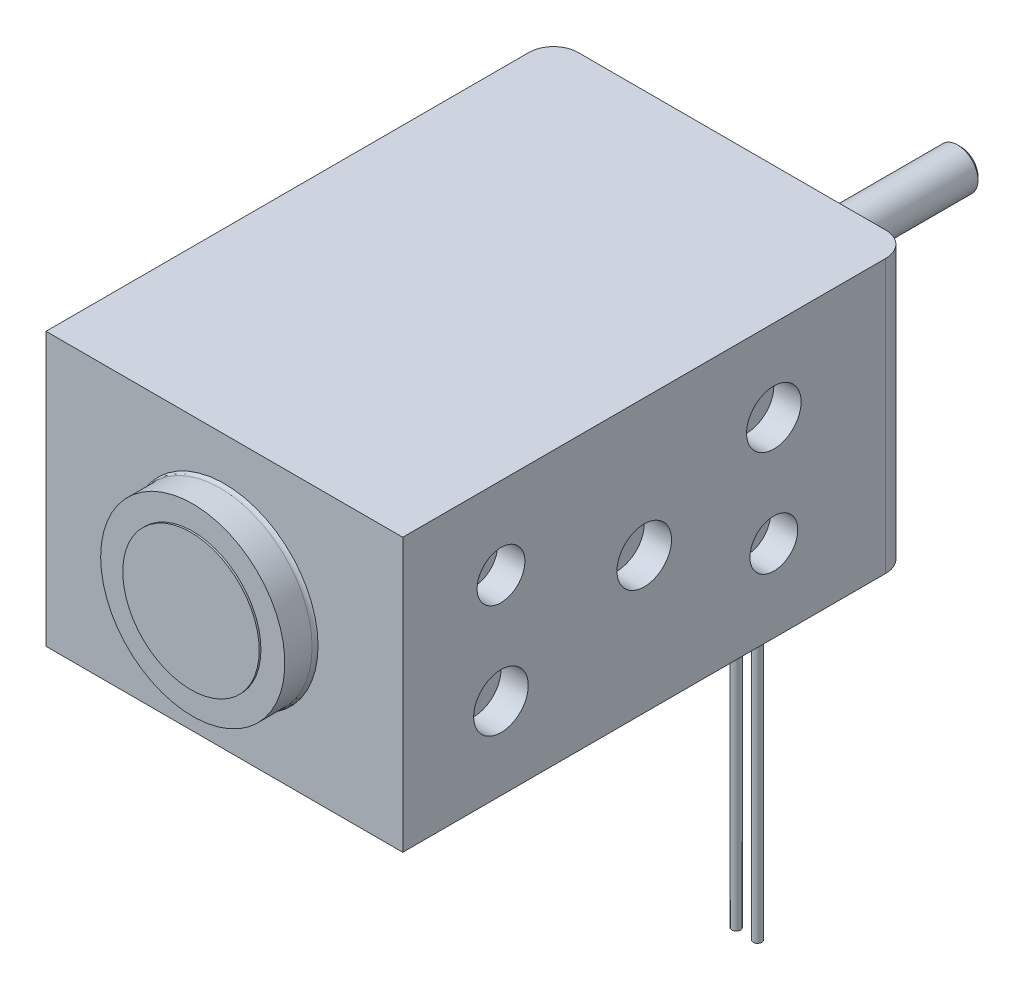
ISO-10303-21;
HEADER;
FILE_DESCRIPTION(('STEP AP214'),'2;1');
FILE_NAME('part.step','',(''),(''),'','','');
FILE_SCHEMA(('AUTOMOTIVE_DESIGN { 1 0 10303 214 1 1 1 1 }'));
ENDSEC;
DATA;
#1=APPLICATION_CONTEXT('core data for automotive mechanical design processes');
#2=APPLICATION_PROTOCOL_DEFINITION('international standard','automotive_design',2000,#1);
#3=PRODUCT_CONTEXT('',#1,'mechanical');
#4=PRODUCT('Part','Part','',(#3));
#5=PRODUCT_RELATED_PRODUCT_CATEGORY('part','',(#4));
#6=PRODUCT_DEFINITION_FORMATION('','',#4);
#7=PRODUCT_DEFINITION_CONTEXT('part definition',#1,'design');
#8=PRODUCT_DEFINITION('design','',#6,#7);
#9=PRODUCT_DEFINITION_SHAPE('','',#8);
#10=(LENGTH_UNIT() NAMED_UNIT(*) SI_UNIT(.MILLI.,.METRE.));
#11=(NAMED_UNIT(*) PLANE_ANGLE_UNIT() SI_UNIT($,.RADIAN.));
#12=(NAMED_UNIT(*) SI_UNIT($,.STERADIAN.) SOLID_ANGLE_UNIT());
#13=UNCERTAINTY_MEASURE_WITH_UNIT(LENGTH_MEASURE(1.E-05),#10,'distance_accuracy_value','');
#14=(GEOMETRIC_REPRESENTATION_CONTEXT(3) GLOBAL_UNCERTAINTY_ASSIGNED_CONTEXT((#13)) GLOBAL_UNIT_ASSIGNED_CONTEXT((#10,
#11,#12)) REPRESENTATION_CONTEXT('',''));
#15=CARTESIAN_POINT('',(0.,0.,0.));
#16=DIRECTION('',(0.,0.,1.));
#17=DIRECTION('',(1.,0.,0.));
#18=AXIS2_PLACEMENT_3D('',#15,#16,#17);
#19=CARTESIAN_POINT('',(-13.0750000000002,8.61064959709757,45.9100000000001));
#20=DIRECTION('',(0.,0.,1.00000000000001));
#21=DIRECTION('',(1.,0.,0.));
#22=AXIS2_PLACEMENT_3D('',#19,#20,#21);
#23=CYLINDRICAL_SURFACE('',#22,5.);
#24=CARTESIAN_POINT('',(-13.0750000000002,8.61064959709754,39.5200000000004));
#25=DIRECTION('',(0.,0.,1.00000000000001));
#26=DIRECTION('',(1.,0.,0.));
#27=AXIS2_PLACEMENT_3D('',#24,#25,#26);
#28=CIRCLE('',#27,5.);
#29=CARTESIAN_POINT('',(-8.07500000000017,8.61064959709754,39.5200000000004));
#30=VERTEX_POINT('',#29);
#31=EDGE_CURVE('E50',#30,#30,#28,.F.);
#32=ORIENTED_EDGE('',*,*,#31,.F.);
#33=EDGE_LOOP('',(#32));
#34=FACE_BOUND('',#33,.T.);
#35=CARTESIAN_POINT('',(-13.0750000000002,8.61064959709754,39.6470000000004));
#36=DIRECTION('',(0.,0.,1.00000000000001));
#37=DIRECTION('',(1.,0.,0.));
#38=AXIS2_PLACEMENT_3D('',#35,#36,#37);
#39=CIRCLE('',#38,5.);
#40=CARTESIAN_POINT('',(-8.07500000000017,8.61064959709754,39.6470000000004));
#41=VERTEX_POINT('',#40);
#42=EDGE_CURVE('E391',#41,#41,#39,.F.);
#43=ORIENTED_EDGE('',*,*,#42,.T.);
#44=EDGE_LOOP('',(#43));
#45=FACE_BOUND('',#44,.T.);
#46=ADVANCED_FACE('F47',(#34,#45),#23,.T.);
#47=CARTESIAN_POINT('',(-13.0750000000002,8.61064959709753,39.5200000000004));
#48=DIRECTION('',(0.,0.,1.00000000000001));
#49=DIRECTION('',(1.,0.,0.));
#50=AXIS2_PLACEMENT_3D('',#47,#48,#49);
#51=PLANE('',#50);
#52=CARTESIAN_POINT('',(-13.0750000000002,8.61064959709753,39.5200000000004));
#53=DIRECTION('',(0.,0.,-1.00000000000001));
#54=DIRECTION('',(-1.,0.,0.));
#55=AXIS2_PLACEMENT_3D('',#52,#53,#54);
#56=CIRCLE('',#55,6.75);
#57=CARTESIAN_POINT('',(-19.8250000000002,8.61064959709753,39.5200000000004));
#58=VERTEX_POINT('',#57);
#59=EDGE_CURVE('E387',#58,#58,#56,.T.);
#60=ORIENTED_EDGE('',*,*,#59,.F.);
#61=EDGE_LOOP('',(#60));
#62=FACE_BOUND('',#61,.T.);
#63=ORIENTED_EDGE('',*,*,#31,.T.);
#64=EDGE_LOOP('',(#63));
#65=FACE_BOUND('',#64,.T.);
#66=ADVANCED_FACE('F248',(#62,#65),#51,.T.);
#67=CARTESIAN_POINT('',(-13.0750000000002,8.6106495970974,-16.7900000000003));
#68=DIRECTION('',(0.,0.,-1.00000000000001));
#69=DIRECTION('',(-1.,0.,0.));
#70=AXIS2_PLACEMENT_3D('',#67,#68,#69);
#71=PLANE('',#70);
#72=CARTESIAN_POINT('',(-13.0750000000002,8.6106495970974,-16.7900000000714));
#73=DIRECTION('',(0.,0.,1.00000000000001));
#74=DIRECTION('',(1.,0.,0.));
#75=AXIS2_PLACEMENT_3D('',#72,#73,#74);
#76=CIRCLE('',#75,1.25000000005166);
#77=CARTESIAN_POINT('',(-11.8249999999485,8.6106495970974,-16.7900000000714));
#78=VERTEX_POINT('',#77);
#79=EDGE_CURVE('E385',#78,#78,#76,.T.);
#80=ORIENTED_EDGE('',*,*,#79,.F.);
#81=EDGE_LOOP('',(#80));
#82=FACE_BOUND('',#81,.T.);
#83=ADVANCED_FACE('F245',(#82),#71,.T.);
#84=CARTESIAN_POINT('',(-6.84869644595532,-25.2393504029029,5.90843329506097));
#85=DIRECTION('',(0.,-1.00000000000001,0.));
#86=DIRECTION('',(0.,0.,-1.00000000000001));
#87=AXIS2_PLACEMENT_3D('',#84,#85,#86);
#88=PLANE('',#87);
#89=CARTESIAN_POINT('',(-6.84869644595532,-25.2393504029029,5.90843329506097));
#90=DIRECTION('',(0.,-1.00000000000001,0.));
#91=DIRECTION('',(0.,0.,-1.00000000000001));
#92=AXIS2_PLACEMENT_3D('',#89,#90,#91);
#93=CIRCLE('',#92,0.3175);
#94=CARTESIAN_POINT('',(-6.84869644595532,-25.2393504029029,5.59093329506096));
#95=VERTEX_POINT('',#94);
#96=EDGE_CURVE('E382',#95,#95,#93,.F.);
#97=ORIENTED_EDGE('',*,*,#96,.F.);
#98=EDGE_LOOP('',(#97));
#99=FACE_BOUND('',#98,.T.);
#100=ADVANCED_FACE('F241',(#99),#88,.T.);
#101=CARTESIAN_POINT('',(-5.29377165765865,-25.2393504029029,5.90843329506097));
#102=DIRECTION('',(0.,-1.00000000000001,0.));
#103=DIRECTION('',(0.,0.,-1.00000000000001));
#104=AXIS2_PLACEMENT_3D('',#101,#102,#103);
#105=PLANE('',#104);
#106=CARTESIAN_POINT('',(-5.29377165765865,-25.2393504029029,5.90843329506097));
#107=DIRECTION('',(0.,-1.00000000000001,0.));
#108=DIRECTION('',(0.,0.,-1.00000000000001));
#109=AXIS2_PLACEMENT_3D('',#106,#107,#108);
#110=CIRCLE('',#109,0.3175);
#111=CARTESIAN_POINT('',(-5.29377165765865,-25.2393504029029,5.59093329506096));
#112=VERTEX_POINT('',#111);
#113=EDGE_CURVE('E379',#112,#112,#110,.F.);
#114=ORIENTED_EDGE('',*,*,#113,.F.);
#115=EDGE_LOOP('',(#114));
#116=FACE_BOUND('',#115,.T.);
#117=ADVANCED_FACE('F237',(#116),#105,.T.);
#118=CARTESIAN_POINT('',(-1.99999999999978,8.6106495970975,19.4999999999999));
#119=DIRECTION('',(1.,0.,0.));
#120=DIRECTION('',(0.,0.,-1.00000000000001));
#121=AXIS2_PLACEMENT_3D('',#118,#119,#120);
#122=PLANE('',#121);
#123=CARTESIAN_POINT('',(-1.99999999999978,8.6106495970975,19.4999999999999));
#124=DIRECTION('',(1.,0.,0.));
#125=DIRECTION('',(0.,0.,-1.00000000000001));
#126=AXIS2_PLACEMENT_3D('',#123,#124,#125);
#127=CIRCLE('',#126,2.);
#128=CARTESIAN_POINT('',(-1.99999999999978,8.61064959709749,17.4999999999998));
#129=VERTEX_POINT('',#128);
#130=EDGE_CURVE('E376',#129,#129,#127,.T.);
#131=ORIENTED_EDGE('',*,*,#130,.T.);
#132=EDGE_LOOP('',(#131));
#133=FACE_BOUND('',#132,.T.);
#134=ADVANCED_FACE('F233',(#133),#122,.T.);
#135=CARTESIAN_POINT('',(-1.99999999999978,12.6106495970975,9.99999999999979));
#136=DIRECTION('',(1.,0.,0.));
#137=DIRECTION('',(0.,0.,-1.00000000000001));
#138=AXIS2_PLACEMENT_3D('',#135,#136,#137);
#139=PLANE('',#138);
#140=CARTESIAN_POINT('',(-1.99999999999978,12.6106495970975,9.99999999999979));
#141=DIRECTION('',(1.,0.,0.));
#142=DIRECTION('',(0.,0.,-1.00000000000001));
#143=AXIS2_PLACEMENT_3D('',#140,#141,#142);
#144=CIRCLE('',#143,2.);
#145=CARTESIAN_POINT('',(-1.99999999999978,12.6106495970975,7.99999999999977));
#146=VERTEX_POINT('',#145);
#147=EDGE_CURVE('E373',#146,#146,#144,.T.);
#148=ORIENTED_EDGE('',*,*,#147,.T.);
#149=EDGE_LOOP('',(#148));
#150=FACE_BOUND('',#149,.T.);
#151=ADVANCED_FACE('F229',(#150),#139,.T.);
#152=CARTESIAN_POINT('',(-1.99999999999978,4.61064959709748,30.0000000000002));
#153=DIRECTION('',(1.,0.,0.));
#154=DIRECTION('',(0.,0.,-1.00000000000001));
#155=AXIS2_PLACEMENT_3D('',#152,#153,#154);
#156=PLANE('',#155);
#157=CARTESIAN_POINT('',(-1.99999999999978,4.61064959709748,30.0000000000002));
#158=DIRECTION('',(1.,0.,0.));
#159=DIRECTION('',(0.,0.,-1.00000000000001));
#160=AXIS2_PLACEMENT_3D('',#157,#158,#159);
#161=CIRCLE('',#160,2.);
#162=CARTESIAN_POINT('',(-1.99999999999978,4.61064959709748,28.0000000000002));
#163=VERTEX_POINT('',#162);
#164=EDGE_CURVE('E370',#163,#163,#161,.T.);
#165=ORIENTED_EDGE('',*,*,#164,.T.);
#166=EDGE_LOOP('',(#165));
#167=FACE_BOUND('',#166,.T.);
#168=ADVANCED_FACE('F225',(#167),#156,.T.);
#169=CARTESIAN_POINT('',(-1.99999999999978,4.61064959709745,9.99999999999979));
#170=DIRECTION('',(1.,0.,0.));
#171=DIRECTION('',(0.,0.,-1.00000000000001));
#172=AXIS2_PLACEMENT_3D('',#169,#170,#171);
#173=PLANE('',#172);
#174=CARTESIAN_POINT('',(-1.99999999999978,4.61064959709745,9.99999999999979));
#175=DIRECTION('',(1.,0.,0.));
#176=DIRECTION('',(0.,0.,-1.00000000000001));
#177=AXIS2_PLACEMENT_3D('',#174,#175,#176);
#178=CIRCLE('',#177,1.7526);
#179=CARTESIAN_POINT('',(-1.99999999999978,4.61064959709744,8.24739999999977));
#180=VERTEX_POINT('',#179);
#181=EDGE_CURVE('E367',#180,#180,#178,.T.);
#182=ORIENTED_EDGE('',*,*,#181,.T.);
#183=EDGE_LOOP('',(#182));
#184=FACE_BOUND('',#183,.T.);
#185=ADVANCED_FACE('F221',(#184),#173,.T.);
#186=CARTESIAN_POINT('',(-1.99999999999978,12.6106495970976,30.0000000000002));
#187=DIRECTION('',(1.,0.,0.));
#188=DIRECTION('',(0.,0.,-1.00000000000001));
#189=AXIS2_PLACEMENT_3D('',#186,#187,#188);
#190=PLANE('',#189);
#191=CARTESIAN_POINT('',(-1.99999999999978,12.6106495970976,30.0000000000002));
#192=DIRECTION('',(1.,0.,0.));
#193=DIRECTION('',(0.,0.,-1.00000000000001));
#194=AXIS2_PLACEMENT_3D('',#191,#192,#193);
#195=CIRCLE('',#194,1.7526);
#196=CARTESIAN_POINT('',(-1.99999999999978,12.6106495970976,28.2474000000002));
#197=VERTEX_POINT('',#196);
#198=EDGE_CURVE('E364',#197,#197,#195,.T.);
#199=ORIENTED_EDGE('',*,*,#198,.T.);
#200=EDGE_LOOP('',(#199));
#201=FACE_BOUND('',#200,.T.);
#202=ADVANCED_FACE('F217',(#201),#190,.T.);
#203=CARTESIAN_POINT('',(-13.0750000000002,8.61064959709753,39.5200000000004));
#204=DIRECTION('',(0.,0.,-1.00000000000001));
#205=DIRECTION('',(-1.,0.,0.));
#206=AXIS2_PLACEMENT_3D('',#203,#204,#205);
#207=CYLINDRICAL_SURFACE('',#206,6.75);
#208=CARTESIAN_POINT('',(-13.0750000000002,8.61064959709753,37.5199999999998));
#209=DIRECTION('',(0.,0.,1.00000000000001));
#210=DIRECTION('',(1.,0.,0.));
#211=AXIS2_PLACEMENT_3D('',#208,#209,#210);
#212=CIRCLE('',#211,6.75);
#213=CARTESIAN_POINT('',(-6.32500000000017,8.61064959709753,37.5199999999998));
#214=VERTEX_POINT('',#213);
#215=EDGE_CURVE('E363',#214,#214,#212,.T.);
#216=ORIENTED_EDGE('',*,*,#215,.T.);
#217=EDGE_LOOP('',(#216));
#218=FACE_BOUND('',#217,.T.);
#219=ORIENTED_EDGE('',*,*,#59,.T.);
#220=EDGE_LOOP('',(#219));
#221=FACE_BOUND('',#220,.T.);
#222=ADVANCED_FACE('F213',(#218,#221),#207,.T.);
#223=CARTESIAN_POINT('',(-24.3500000000001,8.6106495970975,19.4999999999999));
#224=DIRECTION('',(1.,0.,0.));
#225=DIRECTION('',(0.,0.,-1.00000000000001));
#226=AXIS2_PLACEMENT_3D('',#223,#224,#225);
#227=PLANE('',#226);
#228=CARTESIAN_POINT('',(-24.3500000000001,8.6106495970975,19.4999999999999));
#229=DIRECTION('',(-1.,0.,0.));
#230=DIRECTION('',(0.,0.,1.00000000000001));
#231=AXIS2_PLACEMENT_3D('',#228,#229,#230);
#232=CIRCLE('',#231,2.);
#233=CARTESIAN_POINT('',(-24.3500000000001,8.6106495970975,21.4999999999999));
#234=VERTEX_POINT('',#233);
#235=EDGE_CURVE('E360',#234,#234,#232,.T.);
#236=ORIENTED_EDGE('',*,*,#235,.T.);
#237=EDGE_LOOP('',(#236));
#238=FACE_BOUND('',#237,.T.);
#239=ADVANCED_FACE('F209',(#238),#227,.F.);
#240=CARTESIAN_POINT('',(-24.3500000000001,4.61064959709744,9.99999999999979));
#241=DIRECTION('',(1.,0.,0.));
#242=DIRECTION('',(0.,0.,-1.00000000000001));
#243=AXIS2_PLACEMENT_3D('',#240,#241,#242);
#244=PLANE('',#243);
#245=CARTESIAN_POINT('',(-24.3500000000001,4.61064959709744,9.99999999999979));
#246=DIRECTION('',(-1.,0.,0.));
#247=DIRECTION('',(0.,0.,1.00000000000001));
#248=AXIS2_PLACEMENT_3D('',#245,#246,#247);
#249=CIRCLE('',#248,2.00000000000001);
#250=CARTESIAN_POINT('',(-24.3500000000001,4.61064959709745,11.9999999999998));
#251=VERTEX_POINT('',#250);
#252=EDGE_CURVE('E314',#251,#251,#249,.T.);
#253=ORIENTED_EDGE('',*,*,#252,.T.);
#254=EDGE_LOOP('',(#253));
#255=FACE_BOUND('',#254,.T.);
#256=ADVANCED_FACE('F205',(#255),#244,.F.);
#257=CARTESIAN_POINT('',(-24.3500000000001,12.6106495970975,9.99999999999979));
#258=DIRECTION('',(1.,0.,0.));
#259=DIRECTION('',(0.,0.,-1.00000000000001));
#260=AXIS2_PLACEMENT_3D('',#257,#258,#259);
#261=PLANE('',#260);
#262=CARTESIAN_POINT('',(-24.3500000000001,12.6106495970975,9.99999999999979));
#263=DIRECTION('',(-1.,0.,0.));
#264=DIRECTION('',(0.,0.,1.00000000000001));
#265=AXIS2_PLACEMENT_3D('',#262,#263,#264);
#266=CIRCLE('',#265,1.7526);
#267=CARTESIAN_POINT('',(-24.3500000000001,12.6106495970975,11.7525999999998));
#268=VERTEX_POINT('',#267);
#269=EDGE_CURVE('E356',#268,#268,#266,.T.);
#270=ORIENTED_EDGE('',*,*,#269,.T.);
#271=EDGE_LOOP('',(#270));
#272=FACE_BOUND('',#271,.T.);
#273=ADVANCED_FACE('F201',(#272),#261,.F.);
#274=CARTESIAN_POINT('',(-24.3500000000001,4.61064959709748,30.0000000000002));
#275=DIRECTION('',(1.,0.,0.));
#276=DIRECTION('',(0.,0.,-1.00000000000001));
#277=AXIS2_PLACEMENT_3D('',#274,#275,#276);
#278=PLANE('',#277);
#279=CARTESIAN_POINT('',(-24.3500000000001,4.61064959709748,30.0000000000002));
#280=DIRECTION('',(-1.,0.,0.));
#281=DIRECTION('',(0.,0.,1.00000000000001));
#282=AXIS2_PLACEMENT_3D('',#279,#280,#281);
#283=CIRCLE('',#282,1.7526);
#284=CARTESIAN_POINT('',(-24.3500000000001,4.61064959709748,31.7526000000003));
#285=VERTEX_POINT('',#284);
#286=EDGE_CURVE('E353',#285,#285,#283,.T.);
#287=ORIENTED_EDGE('',*,*,#286,.T.);
#288=EDGE_LOOP('',(#287));
#289=FACE_BOUND('',#288,.T.);
#290=ADVANCED_FACE('F197',(#289),#278,.F.);
#291=CARTESIAN_POINT('',(-24.3500000000001,12.6106495970976,30.0000000000002));
#292=DIRECTION('',(1.,0.,0.));
#293=DIRECTION('',(0.,0.,-1.00000000000001));
#294=AXIS2_PLACEMENT_3D('',#291,#292,#293);
#295=PLANE('',#294);
#296=CARTESIAN_POINT('',(-24.3500000000001,12.6106495970976,30.0000000000002));
#297=DIRECTION('',(-1.,0.,0.));
#298=DIRECTION('',(0.,0.,1.00000000000001));
#299=AXIS2_PLACEMENT_3D('',#296,#297,#298);
#300=CIRCLE('',#299,2.);
#301=CARTESIAN_POINT('',(-24.3500000000001,12.6106495970976,32.0000000000003));
#302=VERTEX_POINT('',#301);
#303=EDGE_CURVE('E350',#302,#302,#300,.T.);
#304=ORIENTED_EDGE('',*,*,#303,.T.);
#305=EDGE_LOOP('',(#304));
#306=FACE_BOUND('',#305,.T.);
#307=ADVANCED_FACE('F193',(#306),#295,.F.);
#308=CARTESIAN_POINT('',(-13.0750000000002,8.6106495970974,-16.5400000000773));
#309=DIRECTION('',(0.,0.,1.00000000000001));
#310=DIRECTION('',(1.,0.,0.));
#311=AXIS2_PLACEMENT_3D('',#308,#309,#310);
#312=CONICAL_SURFACE('',#311,1.50000000004739,0.785398163400727);
#313=ORIENTED_EDGE('',*,*,#79,.T.);
#314=EDGE_LOOP('',(#313));
#315=FACE_BOUND('',#314,.T.);
#316=CARTESIAN_POINT('',(-13.0750000000002,8.6106495970974,-16.54));
#317=DIRECTION('',(0.,0.,1.00000000000001));
#318=DIRECTION('',(1.,0.,0.));
#319=AXIS2_PLACEMENT_3D('',#316,#317,#318);
#320=CIRCLE('',#319,1.5);
#321=CARTESIAN_POINT('',(-11.5750000000002,8.6106495970974,-16.54));
#322=VERTEX_POINT('',#321);
#323=EDGE_CURVE('E152',#322,#322,#320,.T.);
#324=ORIENTED_EDGE('',*,*,#323,.F.);
#325=EDGE_LOOP('',(#324));
#326=FACE_BOUND('',#325,.T.);
#327=ADVANCED_FACE('F189',(#315,#326),#312,.T.);
#328=CARTESIAN_POINT('',(-6.84869644595532,9.50867520920438,5.90843329506097));
#329=DIRECTION('',(0.,-1.00000000000001,0.));
#330=DIRECTION('',(0.,0.,-1.00000000000001));
#331=AXIS2_PLACEMENT_3D('',#328,#329,#330);
#332=CYLINDRICAL_SURFACE('',#331,0.3175);
#333=CARTESIAN_POINT('',(-6.84869644595532,-1.3893504029026,5.90843329506097));
#334=DIRECTION('',(0.,-1.00000000000001,0.));
#335=DIRECTION('',(0.,0.,-1.00000000000001));
#336=AXIS2_PLACEMENT_3D('',#333,#334,#335);
#337=CIRCLE('',#336,0.3175);
#338=CARTESIAN_POINT('',(-6.84869644595532,-1.38935040290261,5.59093329506096));
#339=VERTEX_POINT('',#338);
#340=EDGE_CURVE('E347',#339,#339,#337,.F.);
#341=ORIENTED_EDGE('',*,*,#340,.F.);
#342=EDGE_LOOP('',(#341));
#343=FACE_BOUND('',#342,.T.);
#344=ORIENTED_EDGE('',*,*,#96,.T.);
#345=EDGE_LOOP('',(#344));
#346=FACE_BOUND('',#345,.T.);
#347=ADVANCED_FACE('F185',(#343,#346),#332,.T.);
#348=CARTESIAN_POINT('',(-5.29377165765865,9.50867520920438,5.90843329506097));
#349=DIRECTION('',(0.,-1.00000000000001,0.));
#350=DIRECTION('',(0.,0.,-1.00000000000001));
#351=AXIS2_PLACEMENT_3D('',#348,#349,#350);
#352=CYLINDRICAL_SURFACE('',#351,0.3175);
#353=CARTESIAN_POINT('',(-5.29377165765865,-1.3893504029026,5.90843329506097));
#354=DIRECTION('',(0.,-1.00000000000001,0.));
#355=DIRECTION('',(0.,0.,-1.00000000000001));
#356=AXIS2_PLACEMENT_3D('',#353,#354,#355);
#357=CIRCLE('',#356,0.3175);
#358=CARTESIAN_POINT('',(-5.29377165765865,-1.38935040290261,5.59093329506096));
#359=VERTEX_POINT('',#358);
#360=EDGE_CURVE('E344',#359,#359,#357,.F.);
#361=ORIENTED_EDGE('',*,*,#360,.F.);
#362=EDGE_LOOP('',(#361));
#363=FACE_BOUND('',#362,.T.);
#364=ORIENTED_EDGE('',*,*,#113,.T.);
#365=EDGE_LOOP('',(#364));
#366=FACE_BOUND('',#365,.T.);
#367=ADVANCED_FACE('F181',(#363,#366),#352,.T.);
#368=CARTESIAN_POINT('',(-20.,8.6106495970975,19.4999999999999));
#369=DIRECTION('',(1.,0.,0.));
#370=DIRECTION('',(0.,0.,-1.00000000000001));
#371=AXIS2_PLACEMENT_3D('',#368,#369,#370);
#372=CYLINDRICAL_SURFACE('',#371,2.);
#373=ORIENTED_EDGE('',*,*,#130,.F.);
#374=EDGE_LOOP('',(#373));
#375=FACE_BOUND('',#374,.T.);
#376=CARTESIAN_POINT('',(0.,8.6106495970975,19.4999999999999));
#377=DIRECTION('',(1.,0.,0.));
#378=DIRECTION('',(0.,0.,-1.00000000000001));
#379=AXIS2_PLACEMENT_3D('',#376,#377,#378);
#380=CIRCLE('',#379,2.);
#381=CARTESIAN_POINT('',(0.,8.61064959709749,17.4999999999998));
#382=VERTEX_POINT('',#381);
#383=EDGE_CURVE('E341',#382,#382,#380,.T.);
#384=ORIENTED_EDGE('',*,*,#383,.T.);
#385=EDGE_LOOP('',(#384));
#386=FACE_BOUND('',#385,.T.);
#387=ADVANCED_FACE('F177',(#375,#386),#372,.F.);
#388=CARTESIAN_POINT('',(-20.,12.6106495970975,9.99999999999979));
#389=DIRECTION('',(1.,0.,0.));
#390=DIRECTION('',(0.,0.,-1.00000000000001));
#391=AXIS2_PLACEMENT_3D('',#388,#389,#390);
#392=CYLINDRICAL_SURFACE('',#391,2.);
#393=ORIENTED_EDGE('',*,*,#147,.F.);
#394=EDGE_LOOP('',(#393));
#395=FACE_BOUND('',#394,.T.);
#396=CARTESIAN_POINT('',(0.,12.6106495970975,9.99999999999979));
#397=DIRECTION('',(1.,0.,0.));
#398=DIRECTION('',(0.,0.,-1.00000000000001));
#399=AXIS2_PLACEMENT_3D('',#396,#397,#398);
#400=CIRCLE('',#399,2.);
#401=CARTESIAN_POINT('',(0.,12.6106495970975,7.99999999999977));
#402=VERTEX_POINT('',#401);
#403=EDGE_CURVE('E338',#402,#402,#400,.T.);
#404=ORIENTED_EDGE('',*,*,#403,.T.);
#405=EDGE_LOOP('',(#404));
#406=FACE_BOUND('',#405,.T.);
#407=ADVANCED_FACE('F173',(#395,#406),#392,.F.);
#408=CARTESIAN_POINT('',(-20.,4.61064959709748,30.0000000000002));
#409=DIRECTION('',(1.,0.,0.));
#410=DIRECTION('',(0.,0.,-1.00000000000001));
#411=AXIS2_PLACEMENT_3D('',#408,#409,#410);
#412=CYLINDRICAL_SURFACE('',#411,2.);
#413=ORIENTED_EDGE('',*,*,#164,.F.);
#414=EDGE_LOOP('',(#413));
#415=FACE_BOUND('',#414,.T.);
#416=CARTESIAN_POINT('',(0.,4.61064959709748,30.0000000000002));
#417=DIRECTION('',(1.,0.,0.));
#418=DIRECTION('',(0.,0.,-1.00000000000001));
#419=AXIS2_PLACEMENT_3D('',#416,#417,#418);
#420=CIRCLE('',#419,2.);
#421=CARTESIAN_POINT('',(0.,4.61064959709748,28.0000000000002));
#422=VERTEX_POINT('',#421);
#423=EDGE_CURVE('E335',#422,#422,#420,.T.);
#424=ORIENTED_EDGE('',*,*,#423,.T.);
#425=EDGE_LOOP('',(#424));
#426=FACE_BOUND('',#425,.T.);
#427=ADVANCED_FACE('F169',(#415,#426),#412,.F.);
#428=CARTESIAN_POINT('',(-20.,4.61064959709745,9.99999999999979));
#429=DIRECTION('',(1.,0.,0.));
#430=DIRECTION('',(0.,0.,-1.00000000000001));
#431=AXIS2_PLACEMENT_3D('',#428,#429,#430);
#432=CYLINDRICAL_SURFACE('',#431,1.7526);
#433=ORIENTED_EDGE('',*,*,#181,.F.);
#434=EDGE_LOOP('',(#433));
#435=FACE_BOUND('',#434,.T.);
#436=CARTESIAN_POINT('',(0.,4.61064959709745,9.99999999999979));
#437=DIRECTION('',(1.,0.,0.));
#438=DIRECTION('',(0.,0.,-1.00000000000001));
#439=AXIS2_PLACEMENT_3D('',#436,#437,#438);
#440=CIRCLE('',#439,1.7526);
#441=CARTESIAN_POINT('',(0.,4.61064959709744,8.24739999999977));
#442=VERTEX_POINT('',#441);
#443=EDGE_CURVE('E332',#442,#442,#440,.T.);
#444=ORIENTED_EDGE('',*,*,#443,.T.);
#445=EDGE_LOOP('',(#444));
#446=FACE_BOUND('',#445,.T.);
#447=ADVANCED_FACE('F165',(#435,#446),#432,.F.);
#448=CARTESIAN_POINT('',(-20.,12.6106495970976,30.0000000000002));
#449=DIRECTION('',(1.,0.,0.));
#450=DIRECTION('',(0.,0.,-1.00000000000001));
#451=AXIS2_PLACEMENT_3D('',#448,#449,#450);
#452=CYLINDRICAL_SURFACE('',#451,1.7526);
#453=ORIENTED_EDGE('',*,*,#198,.F.);
#454=EDGE_LOOP('',(#453));
#455=FACE_BOUND('',#454,.T.);
#456=CARTESIAN_POINT('',(0.,12.6106495970976,30.0000000000002));
#457=DIRECTION('',(1.,0.,0.));
#458=DIRECTION('',(0.,0.,-1.00000000000001));
#459=AXIS2_PLACEMENT_3D('',#456,#457,#458);
#460=CIRCLE('',#459,1.7526);
#461=CARTESIAN_POINT('',(0.,12.6106495970976,28.2474000000002));
#462=VERTEX_POINT('',#461);
#463=EDGE_CURVE('E142',#462,#462,#460,.T.);
#464=ORIENTED_EDGE('',*,*,#463,.T.);
#465=EDGE_LOOP('',(#464));
#466=FACE_BOUND('',#465,.T.);
#467=ADVANCED_FACE('F160',(#455,#466),#452,.F.);
#468=CARTESIAN_POINT('',(-13.0750000000002,8.61064959709753,37.5199999999998));
#469=DIRECTION('',(0.,0.,1.00000000000001));
#470=DIRECTION('',(1.,0.,0.));
#471=AXIS2_PLACEMENT_3D('',#468,#469,#470);
#472=TOROIDAL_SURFACE('',#471,7.24999999999998,0.5);
#473=ORIENTED_EDGE('',*,*,#215,.F.);
#474=EDGE_LOOP('',(#473));
#475=FACE_BOUND('',#474,.T.);
#476=CARTESIAN_POINT('',(-13.0750000000002,8.61064959709753,37.2000000000003));
#477=DIRECTION('',(0.,0.,1.00000000000001));
#478=DIRECTION('',(1.,0.,0.));
#479=AXIS2_PLACEMENT_3D('',#476,#477,#478);
#480=CIRCLE('',#479,6.86581254575403);
#481=CARTESIAN_POINT('',(-6.20918745424614,8.61064959709753,37.2000000000003));
#482=VERTEX_POINT('',#481);
#483=EDGE_CURVE('E141',#482,#482,#480,.T.);
#484=ORIENTED_EDGE('',*,*,#483,.T.);
#485=EDGE_LOOP('',(#484));
#486=FACE_BOUND('',#485,.T.);
#487=ADVANCED_FACE('F155',(#475,#486),#472,.F.);
#488=CARTESIAN_POINT('',(-6.14999999999988,8.6106495970975,19.4999999999999));
#489=DIRECTION('',(-1.,0.,0.));
#490=DIRECTION('',(0.,0.,1.00000000000001));
#491=AXIS2_PLACEMENT_3D('',#488,#489,#490);
#492=CYLINDRICAL_SURFACE('',#491,2.);
#493=ORIENTED_EDGE('',*,*,#235,.F.);
#494=EDGE_LOOP('',(#493));
#495=FACE_BOUND('',#494,.T.);
#496=CARTESIAN_POINT('',(-26.1499999999999,8.6106495970975,19.4999999999999));
#497=DIRECTION('',(-1.,0.,0.));
#498=DIRECTION('',(0.,0.,1.00000000000001));
#499=AXIS2_PLACEMENT_3D('',#496,#497,#498);
#500=CIRCLE('',#499,2.);
#501=CARTESIAN_POINT('',(-26.1499999999999,8.6106495970975,21.4999999999999));
#502=VERTEX_POINT('',#501);
#503=EDGE_CURVE('E136',#502,#502,#500,.T.);
#504=ORIENTED_EDGE('',*,*,#503,.T.);
#505=EDGE_LOOP('',(#504));
#506=FACE_BOUND('',#505,.T.);
#507=ADVANCED_FACE('F159',(#495,#506),#492,.F.);
#508=CARTESIAN_POINT('',(-6.14999999999988,4.61064959709744,9.99999999999979));
#509=DIRECTION('',(-1.,0.,0.));
#510=DIRECTION('',(0.,0.,1.00000000000001));
#511=AXIS2_PLACEMENT_3D('',#508,#509,#510);
#512=CYLINDRICAL_SURFACE('',#511,2.00000000000001);
#513=ORIENTED_EDGE('',*,*,#252,.F.);
#514=EDGE_LOOP('',(#513));
#515=FACE_BOUND('',#514,.T.);
#516=CARTESIAN_POINT('',(-26.1499999999999,4.61064959709744,9.99999999999979));
#517=DIRECTION('',(-1.,0.,0.));
#518=DIRECTION('',(0.,0.,1.00000000000001));
#519=AXIS2_PLACEMENT_3D('',#516,#517,#518);
#520=CIRCLE('',#519,2.00000000000001);
#521=CARTESIAN_POINT('',(-26.1499999999999,4.61064959709745,11.9999999999998));
#522=VERTEX_POINT('',#521);
#523=EDGE_CURVE('E317',#522,#522,#520,.T.);
#524=ORIENTED_EDGE('',*,*,#523,.T.);
#525=EDGE_LOOP('',(#524));
#526=FACE_BOUND('',#525,.T.);
#527=ADVANCED_FACE('F303',(#515,#526),#512,.F.);
#528=CARTESIAN_POINT('',(-6.14999999999988,12.6106495970975,9.99999999999979));
#529=DIRECTION('',(-1.,0.,0.));
#530=DIRECTION('',(0.,0.,1.00000000000001));
#531=AXIS2_PLACEMENT_3D('',#528,#529,#530);
#532=CYLINDRICAL_SURFACE('',#531,1.7526);
#533=ORIENTED_EDGE('',*,*,#269,.F.);
#534=EDGE_LOOP('',(#533));
#535=FACE_BOUND('',#534,.T.);
#536=CARTESIAN_POINT('',(-26.1499999999999,12.6106495970975,9.99999999999979));
#537=DIRECTION('',(-1.,0.,0.));
#538=DIRECTION('',(0.,0.,1.00000000000001));
#539=AXIS2_PLACEMENT_3D('',#536,#537,#538);
#540=CIRCLE('',#539,1.7526);
#541=CARTESIAN_POINT('',(-26.1499999999999,12.6106495970975,11.7525999999998));
#542=VERTEX_POINT('',#541);
#543=EDGE_CURVE('E319',#542,#542,#540,.T.);
#544=ORIENTED_EDGE('',*,*,#543,.T.);
#545=EDGE_LOOP('',(#544));
#546=FACE_BOUND('',#545,.T.);
#547=ADVANCED_FACE('F300',(#535,#546),#532,.F.);
#548=CARTESIAN_POINT('',(-6.14999999999988,4.61064959709748,30.0000000000002));
#549=DIRECTION('',(-1.,0.,0.));
#550=DIRECTION('',(0.,0.,1.00000000000001));
#551=AXIS2_PLACEMENT_3D('',#548,#549,#550);
#552=CYLINDRICAL_SURFACE('',#551,1.7526);
#553=ORIENTED_EDGE('',*,*,#286,.F.);
#554=EDGE_LOOP('',(#553));
#555=FACE_BOUND('',#554,.T.);
#556=CARTESIAN_POINT('',(-26.1499999999999,4.61064959709748,30.0000000000002));
#557=DIRECTION('',(-1.,0.,0.));
#558=DIRECTION('',(0.,0.,1.00000000000001));
#559=AXIS2_PLACEMENT_3D('',#556,#557,#558);
#560=CIRCLE('',#559,1.7526);
#561=CARTESIAN_POINT('',(-26.1499999999999,4.61064959709748,31.7526000000003));
#562=VERTEX_POINT('',#561);
#563=EDGE_CURVE('E322',#562,#562,#560,.T.);
#564=ORIENTED_EDGE('',*,*,#563,.T.);
#565=EDGE_LOOP('',(#564));
#566=FACE_BOUND('',#565,.T.);
#567=ADVANCED_FACE('F296',(#555,#566),#552,.F.);
#568=CARTESIAN_POINT('',(-6.14999999999988,12.6106495970976,30.0000000000002));
#569=DIRECTION('',(-1.,0.,0.));
#570=DIRECTION('',(0.,0.,1.00000000000001));
#571=AXIS2_PLACEMENT_3D('',#568,#569,#570);
#572=CYLINDRICAL_SURFACE('',#571,2.);
#573=ORIENTED_EDGE('',*,*,#303,.F.);
#574=EDGE_LOOP('',(#573));
#575=FACE_BOUND('',#574,.T.);
#576=CARTESIAN_POINT('',(-26.1499999999999,12.6106495970976,30.0000000000002));
#577=DIRECTION('',(-1.,0.,0.));
#578=DIRECTION('',(0.,0.,1.00000000000001));
#579=AXIS2_PLACEMENT_3D('',#576,#577,#578);
#580=CIRCLE('',#579,2.);
#581=CARTESIAN_POINT('',(-26.1499999999999,12.6106495970976,32.0000000000003));
#582=VERTEX_POINT('',#581);
#583=EDGE_CURVE('E148',#582,#582,#580,.T.);
#584=ORIENTED_EDGE('',*,*,#583,.T.);
#585=EDGE_LOOP('',(#584));
#586=FACE_BOUND('',#585,.T.);
#587=ADVANCED_FACE('F292',(#575,#586),#572,.F.);
#588=CARTESIAN_POINT('',(-13.0750000000002,8.6106495970974,-16.7900000000003));
#589=DIRECTION('',(0.,0.,1.00000000000001));
#590=DIRECTION('',(1.,0.,0.));
#591=AXIS2_PLACEMENT_3D('',#588,#589,#590);
#592=CYLINDRICAL_SURFACE('',#591,1.5);
#593=ORIENTED_EDGE('',*,*,#323,.T.);
#594=EDGE_LOOP('',(#593));
#595=FACE_BOUND('',#594,.T.);
#596=CARTESIAN_POINT('',(-13.0750000000002,8.61064959709743,0.));
#597=DIRECTION('',(0.,0.,1.00000000000001));
#598=DIRECTION('',(1.,0.,0.));
#599=AXIS2_PLACEMENT_3D('',#596,#597,#598);
#600=CIRCLE('',#599,1.5);
#601=CARTESIAN_POINT('',(-11.5750000000002,8.61064959709743,0.));
#602=VERTEX_POINT('',#601);
#603=EDGE_CURVE('E402',#602,#602,#600,.F.);
#604=ORIENTED_EDGE('',*,*,#603,.T.);
#605=EDGE_LOOP('',(#604));
#606=FACE_BOUND('',#605,.T.);
#607=ADVANCED_FACE('F289',(#595,#606),#592,.T.);
#608=CARTESIAN_POINT('',(0.,-1.38935040290254,37.2000000000003));
#609=DIRECTION('',(0.,-1.00000000000001,0.));
#610=DIRECTION('',(0.,0.,-1.00000000000001));
#611=AXIS2_PLACEMENT_3D('',#608,#609,#610);
#612=PLANE('',#611);
#613=DIRECTION('',(0.,0.,-1.00000000000001));
#614=VECTOR('',#613,1.);
#615=CARTESIAN_POINT('',(-26.1499999999999,-1.38935040290254,37.2000000000003));
#616=LINE('',#615,#614);
#617=CARTESIAN_POINT('',(-26.1499999999999,-1.38935040290254,37.2000000000003));
#618=VERTEX_POINT('',#617);
#619=CARTESIAN_POINT('',(-26.1499999999999,-1.3893504029026,1.80000000000025));
#620=VERTEX_POINT('',#619);
#621=EDGE_CURVE('E99',#618,#620,#616,.T.);
#622=ORIENTED_EDGE('',*,*,#621,.T.);
#623=CARTESIAN_POINT('',(-24.3500000000001,-1.3893504029026,1.80000000000025));
#624=DIRECTION('',(0.,1.00000000000001,0.));
#625=DIRECTION('',(0.,0.,1.00000000000001));
#626=AXIS2_PLACEMENT_3D('',#623,#624,#625);
#627=CIRCLE('',#626,1.8);
#628=CARTESIAN_POINT('',(-24.3500000000001,-1.3893504029026,0.));
#629=VERTEX_POINT('',#628);
#630=EDGE_CURVE('E90',#629,#620,#627,.T.);
#631=ORIENTED_EDGE('',*,*,#630,.F.);
#632=DIRECTION('',(1.,0.,0.));
#633=VECTOR('',#632,1.);
#634=CARTESIAN_POINT('',(-26.1499999999999,-1.3893504029026,0.));
#635=LINE('',#634,#633);
#636=CARTESIAN_POINT('',(-1.7999999999998,-1.3893504029026,0.));
#637=VERTEX_POINT('',#636);
#638=EDGE_CURVE('E143',#629,#637,#635,.T.);
#639=ORIENTED_EDGE('',*,*,#638,.T.);
#640=CARTESIAN_POINT('',(-1.7999999999998,-1.3893504029026,1.80000000000025));
#641=DIRECTION('',(0.,1.00000000000001,0.));
#642=DIRECTION('',(0.,0.,1.00000000000001));
#643=AXIS2_PLACEMENT_3D('',#640,#641,#642);
#644=CIRCLE('',#643,1.8);
#645=CARTESIAN_POINT('',(0.,-1.3893504029026,1.80000000000025));
#646=VERTEX_POINT('',#645);
#647=EDGE_CURVE('E145',#646,#637,#644,.T.);
#648=ORIENTED_EDGE('',*,*,#647,.F.);
#649=DIRECTION('',(0.,0.,1.00000000000001));
#650=VECTOR('',#649,1.);
#651=CARTESIAN_POINT('',(0.,-1.3893504029026,0.));
#652=LINE('',#651,#650);
#653=CARTESIAN_POINT('',(0.,-1.38935040290254,37.2000000000003));
#654=VERTEX_POINT('',#653);
#655=EDGE_CURVE('E138',#646,#654,#652,.T.);
#656=ORIENTED_EDGE('',*,*,#655,.T.);
#657=DIRECTION('',(-1.,0.,0.));
#658=VECTOR('',#657,1.);
#659=CARTESIAN_POINT('',(-24.1500000000001,-1.38935040290254,37.2000000000003));
#660=LINE('',#659,#658);
#661=EDGE_CURVE('E137',#654,#618,#660,.T.);
#662=ORIENTED_EDGE('',*,*,#661,.T.);
#663=EDGE_LOOP('',(#622,#631,#639,#648,#656,#662));
#664=FACE_BOUND('',#663,.T.);
#665=ORIENTED_EDGE('',*,*,#360,.T.);
#666=EDGE_LOOP('',(#665));
#667=FACE_BOUND('',#666,.T.);
#668=ORIENTED_EDGE('',*,*,#340,.T.);
#669=EDGE_LOOP('',(#668));
#670=FACE_BOUND('',#669,.T.);
#671=ADVANCED_FACE('F285',(#664,#667,#670),#612,.T.);
#672=CARTESIAN_POINT('',(0.,-1.3893504029026,0.));
#673=DIRECTION('',(-1.,0.,0.));
#674=DIRECTION('',(0.,0.,1.00000000000001));
#675=AXIS2_PLACEMENT_3D('',#672,#673,#674);
#676=PLANE('',#675);
#677=DIRECTION('',(0.,1.00000000000001,0.));
#678=VECTOR('',#677,1.);
#679=CARTESIAN_POINT('',(0.,-1.38935040290254,37.2000000000003));
#680=LINE('',#679,#678);
#681=CARTESIAN_POINT('',(0.,18.6106495970976,37.2000000000003));
#682=VERTEX_POINT('',#681);
#683=EDGE_CURVE('E128',#682,#654,#680,.F.);
#684=ORIENTED_EDGE('',*,*,#683,.T.);
#685=ORIENTED_EDGE('',*,*,#655,.F.);
#686=DIRECTION('',(0.,1.00000000000001,0.));
#687=VECTOR('',#686,1.);
#688=CARTESIAN_POINT('',(0.,-1.3893504029026,1.80000000000025));
#689=LINE('',#688,#687);
#690=CARTESIAN_POINT('',(0.,18.6106495970975,1.80000000000025));
#691=VERTEX_POINT('',#690);
#692=EDGE_CURVE('E131',#691,#646,#689,.F.);
#693=ORIENTED_EDGE('',*,*,#692,.F.);
#694=DIRECTION('',(0.,0.,-1.00000000000001));
#695=VECTOR('',#694,1.);
#696=CARTESIAN_POINT('',(0.,18.6106495970976,37.2000000000003));
#697=LINE('',#696,#695);
#698=EDGE_CURVE('E129',#691,#682,#697,.F.);
#699=ORIENTED_EDGE('',*,*,#698,.T.);
#700=EDGE_LOOP('',(#684,#685,#693,#699));
#701=FACE_BOUND('',#700,.T.);
#702=ORIENTED_EDGE('',*,*,#463,.F.);
#703=EDGE_LOOP('',(#702));
#704=FACE_BOUND('',#703,.T.);
#705=ORIENTED_EDGE('',*,*,#443,.F.);
#706=EDGE_LOOP('',(#705));
#707=FACE_BOUND('',#706,.T.);
#708=ORIENTED_EDGE('',*,*,#423,.F.);
#709=EDGE_LOOP('',(#708));
#710=FACE_BOUND('',#709,.T.);
#711=ORIENTED_EDGE('',*,*,#403,.F.);
#712=EDGE_LOOP('',(#711));
#713=FACE_BOUND('',#712,.T.);
#714=ORIENTED_EDGE('',*,*,#383,.F.);
#715=EDGE_LOOP('',(#714));
#716=FACE_BOUND('',#715,.T.);
#717=ADVANCED_FACE('F282',(#701,#704,#707,#710,#713,#716),#676,.F.);
#718=CARTESIAN_POINT('',(-24.1500000000001,-1.38935040290254,37.2000000000003));
#719=DIRECTION('',(0.,0.,-1.00000000000001));
#720=DIRECTION('',(-1.,0.,0.));
#721=AXIS2_PLACEMENT_3D('',#718,#719,#720);
#722=PLANE('',#721);
#723=DIRECTION('',(1.,0.,0.));
#724=VECTOR('',#723,1.);
#725=CARTESIAN_POINT('',(0.,18.6106495970976,37.2000000000003));
#726=LINE('',#725,#724);
#727=CARTESIAN_POINT('',(-26.1499999999999,18.6106495970976,37.2000000000003));
#728=VERTEX_POINT('',#727);
#729=EDGE_CURVE('E120',#682,#728,#726,.F.);
#730=ORIENTED_EDGE('',*,*,#729,.T.);
#731=DIRECTION('',(0.,1.00000000000001,0.));
#732=VECTOR('',#731,1.);
#733=CARTESIAN_POINT('',(-26.1499999999999,-1.38935040290254,37.2000000000003));
#734=LINE('',#733,#732);
#735=EDGE_CURVE('E107',#728,#618,#734,.F.);
#736=ORIENTED_EDGE('',*,*,#735,.T.);
#737=ORIENTED_EDGE('',*,*,#661,.F.);
#738=ORIENTED_EDGE('',*,*,#683,.F.);
#739=EDGE_LOOP('',(#730,#736,#737,#738));
#740=FACE_BOUND('',#739,.T.);
#741=ORIENTED_EDGE('',*,*,#483,.F.);
#742=EDGE_LOOP('',(#741));
#743=FACE_BOUND('',#742,.T.);
#744=ADVANCED_FACE('F125',(#740,#743),#722,.F.);
#745=CARTESIAN_POINT('',(-26.1499999999999,-1.38935040290254,37.2000000000003));
#746=DIRECTION('',(1.,0.,0.));
#747=DIRECTION('',(0.,0.,-1.00000000000001));
#748=AXIS2_PLACEMENT_3D('',#745,#746,#747);
#749=PLANE('',#748);
#750=DIRECTION('',(0.,0.,-1.00000000000001));
#751=VECTOR('',#750,1.);
#752=CARTESIAN_POINT('',(-26.1499999999999,18.6106495970976,37.2000000000003));
#753=LINE('',#752,#751);
#754=CARTESIAN_POINT('',(-26.1499999999999,18.6106495970975,1.80000000000025));
#755=VERTEX_POINT('',#754);
#756=EDGE_CURVE('E111',#728,#755,#753,.T.);
#757=ORIENTED_EDGE('',*,*,#756,.T.);
#758=DIRECTION('',(0.,1.00000000000001,0.));
#759=VECTOR('',#758,1.);
#760=CARTESIAN_POINT('',(-26.1499999999999,-1.3893504029026,1.80000000000025));
#761=LINE('',#760,#759);
#762=EDGE_CURVE('E403',#620,#755,#761,.T.);
#763=ORIENTED_EDGE('',*,*,#762,.F.);
#764=ORIENTED_EDGE('',*,*,#621,.F.);
#765=ORIENTED_EDGE('',*,*,#735,.F.);
#766=EDGE_LOOP('',(#757,#763,#764,#765));
#767=FACE_BOUND('',#766,.T.);
#768=ORIENTED_EDGE('',*,*,#583,.F.);
#769=EDGE_LOOP('',(#768));
#770=FACE_BOUND('',#769,.T.);
#771=ORIENTED_EDGE('',*,*,#563,.F.);
#772=EDGE_LOOP('',(#771));
#773=FACE_BOUND('',#772,.T.);
#774=ORIENTED_EDGE('',*,*,#543,.F.);
#775=EDGE_LOOP('',(#774));
#776=FACE_BOUND('',#775,.T.);
#777=ORIENTED_EDGE('',*,*,#523,.F.);
#778=EDGE_LOOP('',(#777));
#779=FACE_BOUND('',#778,.T.);
#780=ORIENTED_EDGE('',*,*,#503,.F.);
#781=EDGE_LOOP('',(#780));
#782=FACE_BOUND('',#781,.T.);
#783=ADVANCED_FACE('F109',(#767,#770,#773,#776,#779,#782),#749,.F.);
#784=CARTESIAN_POINT('',(-24.3500000000001,-1.3893504029026,1.80000000000025));
#785=DIRECTION('',(0.,1.00000000000001,0.));
#786=DIRECTION('',(0.,0.,1.00000000000001));
#787=AXIS2_PLACEMENT_3D('',#784,#785,#786);
#788=CYLINDRICAL_SURFACE('',#787,1.8);
#789=CARTESIAN_POINT('',(-24.3500000000001,18.6106495970975,1.80000000000025));
#790=DIRECTION('',(0.,1.00000000000001,0.));
#791=DIRECTION('',(0.,0.,1.00000000000001));
#792=AXIS2_PLACEMENT_3D('',#789,#790,#791);
#793=CIRCLE('',#792,1.8);
#794=CARTESIAN_POINT('',(-24.3500000000001,18.6106495970975,0.));
#795=VERTEX_POINT('',#794);
#796=EDGE_CURVE('E123',#755,#795,#793,.F.);
#797=ORIENTED_EDGE('',*,*,#796,.T.);
#798=DIRECTION('',(0.,1.00000000000001,0.));
#799=VECTOR('',#798,1.);
#800=CARTESIAN_POINT('',(-24.3500000000001,-1.3893504029026,0.));
#801=LINE('',#800,#799);
#802=EDGE_CURVE('E146',#795,#629,#801,.F.);
#803=ORIENTED_EDGE('',*,*,#802,.T.);
#804=ORIENTED_EDGE('',*,*,#630,.T.);
#805=ORIENTED_EDGE('',*,*,#762,.T.);
#806=EDGE_LOOP('',(#797,#803,#804,#805));
#807=FACE_BOUND('',#806,.T.);
#808=ADVANCED_FACE('F274',(#807),#788,.T.);
#809=CARTESIAN_POINT('',(-26.1499999999999,-1.3893504029026,0.));
#810=DIRECTION('',(0.,0.,1.00000000000001));
#811=DIRECTION('',(1.,0.,0.));
#812=AXIS2_PLACEMENT_3D('',#809,#810,#811);
#813=PLANE('',#812);
#814=DIRECTION('',(0.,1.00000000000001,0.));
#815=VECTOR('',#814,1.);
#816=CARTESIAN_POINT('',(-1.7999999999998,-1.3893504029026,0.));
#817=LINE('',#816,#815);
#818=CARTESIAN_POINT('',(-1.7999999999998,18.6106495970975,0.));
#819=VERTEX_POINT('',#818);
#820=EDGE_CURVE('E64',#637,#819,#817,.T.);
#821=ORIENTED_EDGE('',*,*,#820,.F.);
#822=ORIENTED_EDGE('',*,*,#638,.F.);
#823=ORIENTED_EDGE('',*,*,#802,.F.);
#824=DIRECTION('',(1.,0.,0.));
#825=VECTOR('',#824,1.);
#826=CARTESIAN_POINT('',(0.,18.6106495970975,0.));
#827=LINE('',#826,#825);
#828=EDGE_CURVE('E56',#795,#819,#827,.T.);
#829=ORIENTED_EDGE('',*,*,#828,.T.);
#830=EDGE_LOOP('',(#821,#822,#823,#829));
#831=FACE_BOUND('',#830,.T.);
#832=ORIENTED_EDGE('',*,*,#603,.F.);
#833=EDGE_LOOP('',(#832));
#834=FACE_BOUND('',#833,.T.);
#835=ADVANCED_FACE('F271',(#831,#834),#813,.F.);
#836=CARTESIAN_POINT('',(-1.7999999999998,-1.3893504029026,1.80000000000025));
#837=DIRECTION('',(0.,1.00000000000001,0.));
#838=DIRECTION('',(0.,0.,1.00000000000001));
#839=AXIS2_PLACEMENT_3D('',#836,#837,#838);
#840=CYLINDRICAL_SURFACE('',#839,1.8);
#841=CARTESIAN_POINT('',(-1.7999999999998,18.6106495970975,1.80000000000025));
#842=DIRECTION('',(0.,1.00000000000001,0.));
#843=DIRECTION('',(0.,0.,1.00000000000001));
#844=AXIS2_PLACEMENT_3D('',#841,#842,#843);
#845=CIRCLE('',#844,1.8);
#846=EDGE_CURVE('E15',#819,#691,#845,.F.);
#847=ORIENTED_EDGE('',*,*,#846,.T.);
#848=ORIENTED_EDGE('',*,*,#692,.T.);
#849=ORIENTED_EDGE('',*,*,#647,.T.);
#850=ORIENTED_EDGE('',*,*,#820,.T.);
#851=EDGE_LOOP('',(#847,#848,#849,#850));
#852=FACE_BOUND('',#851,.T.);
#853=ADVANCED_FACE('F265',(#852),#840,.T.);
#854=CARTESIAN_POINT('',(0.,18.6106495970976,37.2000000000003));
#855=DIRECTION('',(0.,-1.00000000000001,0.));
#856=DIRECTION('',(0.,0.,-1.00000000000001));
#857=AXIS2_PLACEMENT_3D('',#854,#855,#856);
#858=PLANE('',#857);
#859=ORIENTED_EDGE('',*,*,#828,.F.);
#860=ORIENTED_EDGE('',*,*,#796,.F.);
#861=ORIENTED_EDGE('',*,*,#756,.F.);
#862=ORIENTED_EDGE('',*,*,#729,.F.);
#863=ORIENTED_EDGE('',*,*,#698,.F.);
#864=ORIENTED_EDGE('',*,*,#846,.F.);
#865=EDGE_LOOP('',(#859,#860,#861,#862,#863,#864));
#866=FACE_BOUND('',#865,.T.);
#867=ADVANCED_FACE('F119',(#866),#858,.F.);
#868=CARTESIAN_POINT('',(-13.0750000000002,8.61064959709753,39.6470000000004));
#869=DIRECTION('',(0.,0.,1.00000000000001));
#870=DIRECTION('',(1.,0.,0.));
#871=AXIS2_PLACEMENT_3D('',#868,#869,#870);
#872=PLANE('',#871);
#873=ORIENTED_EDGE('',*,*,#42,.F.);
#874=EDGE_LOOP('',(#873));
#875=FACE_BOUND('',#874,.T.);
#876=ADVANCED_FACE('F252',(#875),#872,.T.);
#877=CLOSED_SHELL('',(#46,#66,#83,#100,#117,#134,#151,#168,#185,#202,#222,#239,#256,#273,#290,
#307,#327,#347,#367,#387,#407,#427,#447,#467,#487,#507,#527,#547,#567,#587,#607,#671,#717,#744,
#783,#808,#835,#853,#867,#876));
#878=MANIFOLD_SOLID_BREP('B2',#877);
#879=ADVANCED_BREP_SHAPE_REPRESENTATION('',(#18,#878),#14);
#880=SHAPE_DEFINITION_REPRESENTATION(#9,#879);
ENDSEC;
END-ISO-10303-21;
